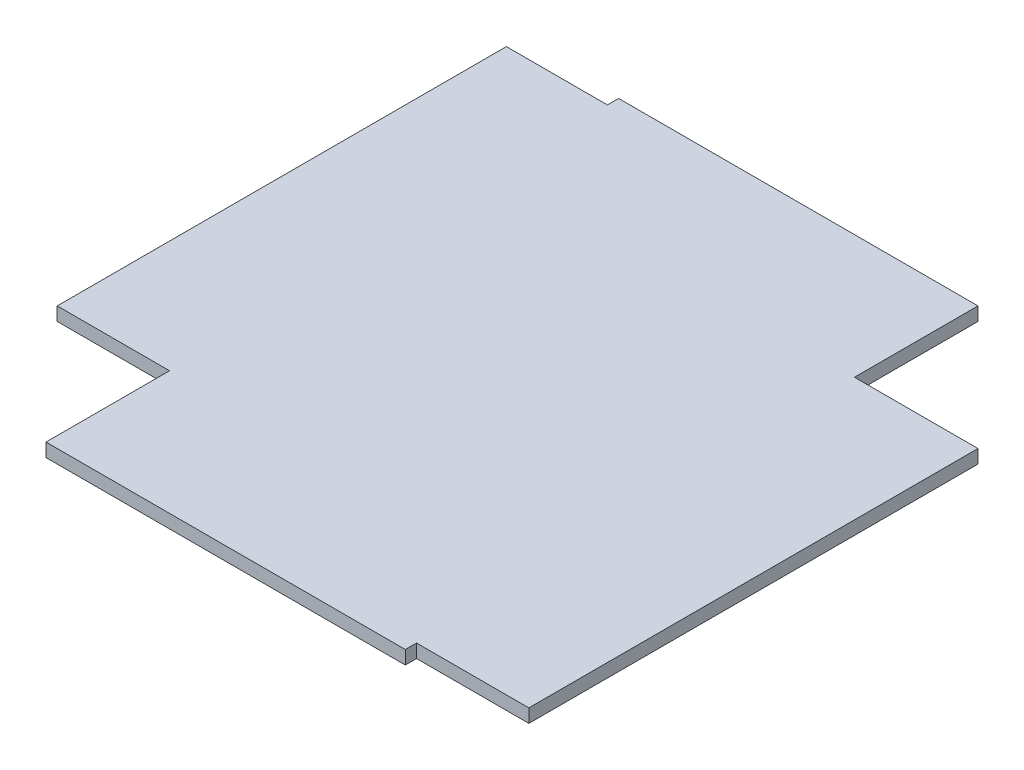
ISO-10303-21;
HEADER;
FILE_DESCRIPTION(('STEP AP214'),'2;1');
FILE_NAME('part.step','',(''),(''),'','','');
FILE_SCHEMA(('AUTOMOTIVE_DESIGN { 1 0 10303 214 1 1 1 1 }'));
ENDSEC;
DATA;
#1=APPLICATION_CONTEXT('core data for automotive mechanical design processes');
#2=APPLICATION_PROTOCOL_DEFINITION('international standard','automotive_design',2000,#1);
#3=PRODUCT_CONTEXT('',#1,'mechanical');
#4=PRODUCT('Part','Part','',(#3));
#5=PRODUCT_RELATED_PRODUCT_CATEGORY('part','',(#4));
#6=PRODUCT_DEFINITION_FORMATION('','',#4);
#7=PRODUCT_DEFINITION_CONTEXT('part definition',#1,'design');
#8=PRODUCT_DEFINITION('design','',#6,#7);
#9=PRODUCT_DEFINITION_SHAPE('','',#8);
#10=(LENGTH_UNIT() NAMED_UNIT(*) SI_UNIT(.MILLI.,.METRE.));
#11=(NAMED_UNIT(*) PLANE_ANGLE_UNIT() SI_UNIT($,.RADIAN.));
#12=(NAMED_UNIT(*) SI_UNIT($,.STERADIAN.) SOLID_ANGLE_UNIT());
#13=UNCERTAINTY_MEASURE_WITH_UNIT(LENGTH_MEASURE(1.E-05),#10,'distance_accuracy_value','');
#14=(GEOMETRIC_REPRESENTATION_CONTEXT(3) GLOBAL_UNCERTAINTY_ASSIGNED_CONTEXT((#13)) GLOBAL_UNIT_ASSIGNED_CONTEXT((#10,
#11,#12)) REPRESENTATION_CONTEXT('',''));
#15=CARTESIAN_POINT('',(0.,0.,0.));
#16=DIRECTION('',(0.,0.,1.));
#17=DIRECTION('',(1.,0.,0.));
#18=AXIS2_PLACEMENT_3D('',#15,#16,#17);
#19=CARTESIAN_POINT('',(-75.,6.,-75.));
#20=DIRECTION('',(0.,0.,1.));
#21=DIRECTION('',(1.,0.,0.));
#22=AXIS2_PLACEMENT_3D('',#19,#20,#21);
#23=PLANE('',#22);
#24=DIRECTION('',(-1.,0.,0.));
#25=VECTOR('',#24,1.);
#26=CARTESIAN_POINT('',(-75.,0.,-75.));
#27=LINE('',#26,#25);
#28=CARTESIAN_POINT('',(130.,0.,-75.));
#29=VERTEX_POINT('',#28);
#30=CARTESIAN_POINT('',(75.,0.,-75.));
#31=VERTEX_POINT('',#30);
#32=EDGE_CURVE('E138',#29,#31,#27,.T.);
#33=ORIENTED_EDGE('',*,*,#32,.T.);
#34=DIRECTION('',(0.,1.,0.));
#35=VECTOR('',#34,1.);
#36=CARTESIAN_POINT('',(75.,0.,-75.));
#37=LINE('',#36,#35);
#38=CARTESIAN_POINT('',(75.,6.,-75.));
#39=VERTEX_POINT('',#38);
#40=EDGE_CURVE('E121',#31,#39,#37,.T.);
#41=ORIENTED_EDGE('',*,*,#40,.T.);
#42=DIRECTION('',(-1.,0.,0.));
#43=VECTOR('',#42,1.);
#44=CARTESIAN_POINT('',(-75.,6.,-75.));
#45=LINE('',#44,#43);
#46=CARTESIAN_POINT('',(130.,6.,-75.));
#47=VERTEX_POINT('',#46);
#48=EDGE_CURVE('E147',#47,#39,#45,.T.);
#49=ORIENTED_EDGE('',*,*,#48,.F.);
#50=DIRECTION('',(0.,1.,0.));
#51=VECTOR('',#50,1.);
#52=CARTESIAN_POINT('',(130.,0.,-75.));
#53=LINE('',#52,#51);
#54=EDGE_CURVE('E145',#29,#47,#53,.T.);
#55=ORIENTED_EDGE('',*,*,#54,.F.);
#56=EDGE_LOOP('',(#33,#41,#49,#55));
#57=FACE_BOUND('',#56,.T.);
#58=ADVANCED_FACE('F33',(#57),#23,.F.);
#59=CARTESIAN_POINT('',(0.,6.,0.));
#60=DIRECTION('',(0.,1.,0.));
#61=DIRECTION('',(0.,0.,1.));
#62=AXIS2_PLACEMENT_3D('',#59,#60,#61);
#63=PLANE('',#62);
#64=DIRECTION('',(0.,0.,1.));
#65=VECTOR('',#64,1.);
#66=CARTESIAN_POINT('',(-85.,6.,-75.));
#67=LINE('',#66,#65);
#68=CARTESIAN_POINT('',(-85.,6.,-130.));
#69=VERTEX_POINT('',#68);
#70=CARTESIAN_POINT('',(-85.,6.,-125.));
#71=VERTEX_POINT('',#70);
#72=EDGE_CURVE('E47',#69,#71,#67,.T.);
#73=ORIENTED_EDGE('',*,*,#72,.T.);
#74=DIRECTION('',(-1.,0.,0.));
#75=VECTOR('',#74,1.);
#76=CARTESIAN_POINT('',(-75.,6.,-125.));
#77=LINE('',#76,#75);
#78=CARTESIAN_POINT('',(-130.,6.,-125.));
#79=VERTEX_POINT('',#78);
#80=EDGE_CURVE('E209',#71,#79,#77,.T.);
#81=ORIENTED_EDGE('',*,*,#80,.T.);
#82=DIRECTION('',(0.,0.,1.));
#83=VECTOR('',#82,1.);
#84=CARTESIAN_POINT('',(-130.,6.,75.0000000000001));
#85=LINE('',#84,#83);
#86=CARTESIAN_POINT('',(-130.,6.,75.0000000000001));
#87=VERTEX_POINT('',#86);
#88=EDGE_CURVE('E206',#79,#87,#85,.T.);
#89=ORIENTED_EDGE('',*,*,#88,.T.);
#90=DIRECTION('',(1.,0.,0.));
#91=VECTOR('',#90,1.);
#92=CARTESIAN_POINT('',(-75.,6.,75.0000000000001));
#93=LINE('',#92,#91);
#94=CARTESIAN_POINT('',(-80.,6.,75.0000000000001));
#95=VERTEX_POINT('',#94);
#96=EDGE_CURVE('E202',#87,#95,#93,.T.);
#97=ORIENTED_EDGE('',*,*,#96,.T.);
#98=DIRECTION('',(0.,0.,1.));
#99=VECTOR('',#98,1.);
#100=CARTESIAN_POINT('',(-80.,6.,75.));
#101=LINE('',#100,#99);
#102=CARTESIAN_POINT('',(-80.,6.,130.));
#103=VERTEX_POINT('',#102);
#104=EDGE_CURVE('E186',#95,#103,#101,.T.);
#105=ORIENTED_EDGE('',*,*,#104,.T.);
#106=DIRECTION('',(1.,0.,0.));
#107=VECTOR('',#106,1.);
#108=CARTESIAN_POINT('',(80.,6.,130.));
#109=LINE('',#108,#107);
#110=CARTESIAN_POINT('',(80.,6.,130.));
#111=VERTEX_POINT('',#110);
#112=EDGE_CURVE('E184',#103,#111,#109,.T.);
#113=ORIENTED_EDGE('',*,*,#112,.T.);
#114=DIRECTION('',(0.,0.,-1.));
#115=VECTOR('',#114,1.);
#116=CARTESIAN_POINT('',(80.,6.,75.));
#117=LINE('',#116,#115);
#118=CARTESIAN_POINT('',(80.,6.,125.));
#119=VERTEX_POINT('',#118);
#120=EDGE_CURVE('E53',#111,#119,#117,.T.);
#121=ORIENTED_EDGE('',*,*,#120,.T.);
#122=DIRECTION('',(1.,0.,0.));
#123=VECTOR('',#122,1.);
#124=CARTESIAN_POINT('',(75.,6.,125.));
#125=LINE('',#124,#123);
#126=CARTESIAN_POINT('',(130.,6.,125.));
#127=VERTEX_POINT('',#126);
#128=EDGE_CURVE('E162',#119,#127,#125,.T.);
#129=ORIENTED_EDGE('',*,*,#128,.T.);
#130=DIRECTION('',(0.,0.,-1.));
#131=VECTOR('',#130,1.);
#132=CARTESIAN_POINT('',(130.,6.,-75.));
#133=LINE('',#132,#131);
#134=EDGE_CURVE('E167',#127,#47,#133,.T.);
#135=ORIENTED_EDGE('',*,*,#134,.T.);
#136=ORIENTED_EDGE('',*,*,#48,.T.);
#137=DIRECTION('',(0.,0.,-1.));
#138=VECTOR('',#137,1.);
#139=CARTESIAN_POINT('',(75.,6.,-75.));
#140=LINE('',#139,#138);
#141=CARTESIAN_POINT('',(75.,6.,-130.));
#142=VERTEX_POINT('',#141);
#143=EDGE_CURVE('E127',#39,#142,#140,.T.);
#144=ORIENTED_EDGE('',*,*,#143,.T.);
#145=DIRECTION('',(-1.,0.,0.));
#146=VECTOR('',#145,1.);
#147=CARTESIAN_POINT('',(-85.,6.,-130.));
#148=LINE('',#147,#146);
#149=EDGE_CURVE('E220',#142,#69,#148,.T.);
#150=ORIENTED_EDGE('',*,*,#149,.T.);
#151=EDGE_LOOP('',(#73,#81,#89,#97,#105,#113,#121,#129,#135,#136,#144,#150));
#152=FACE_BOUND('',#151,.T.);
#153=ADVANCED_FACE('F239',(#152),#63,.T.);
#154=CARTESIAN_POINT('',(0.,0.,0.));
#155=DIRECTION('',(0.,1.,0.));
#156=DIRECTION('',(0.,0.,1.));
#157=AXIS2_PLACEMENT_3D('',#154,#155,#156);
#158=PLANE('',#157);
#159=DIRECTION('',(-1.,0.,0.));
#160=VECTOR('',#159,1.);
#161=CARTESIAN_POINT('',(-75.,0.,-125.));
#162=LINE('',#161,#160);
#163=CARTESIAN_POINT('',(-85.,0.,-125.));
#164=VERTEX_POINT('',#163);
#165=CARTESIAN_POINT('',(-130.,0.,-125.));
#166=VERTEX_POINT('',#165);
#167=EDGE_CURVE('E205',#164,#166,#162,.T.);
#168=ORIENTED_EDGE('',*,*,#167,.F.);
#169=DIRECTION('',(0.,0.,1.));
#170=VECTOR('',#169,1.);
#171=CARTESIAN_POINT('',(-85.,0.,-75.));
#172=LINE('',#171,#170);
#173=CARTESIAN_POINT('',(-85.,0.,-130.));
#174=VERTEX_POINT('',#173);
#175=EDGE_CURVE('E142',#174,#164,#172,.T.);
#176=ORIENTED_EDGE('',*,*,#175,.F.);
#177=DIRECTION('',(-1.,0.,0.));
#178=VECTOR('',#177,1.);
#179=CARTESIAN_POINT('',(-85.,0.,-130.));
#180=LINE('',#179,#178);
#181=CARTESIAN_POINT('',(75.,0.,-130.));
#182=VERTEX_POINT('',#181);
#183=EDGE_CURVE('E132',#182,#174,#180,.T.);
#184=ORIENTED_EDGE('',*,*,#183,.F.);
#185=DIRECTION('',(0.,0.,-1.));
#186=VECTOR('',#185,1.);
#187=CARTESIAN_POINT('',(75.,0.,-75.));
#188=LINE('',#187,#186);
#189=EDGE_CURVE('E124',#31,#182,#188,.T.);
#190=ORIENTED_EDGE('',*,*,#189,.F.);
#191=ORIENTED_EDGE('',*,*,#32,.F.);
#192=DIRECTION('',(0.,0.,-1.));
#193=VECTOR('',#192,1.);
#194=CARTESIAN_POINT('',(130.,0.,-75.));
#195=LINE('',#194,#193);
#196=CARTESIAN_POINT('',(130.,0.,125.));
#197=VERTEX_POINT('',#196);
#198=EDGE_CURVE('E175',#197,#29,#195,.T.);
#199=ORIENTED_EDGE('',*,*,#198,.F.);
#200=DIRECTION('',(1.,0.,0.));
#201=VECTOR('',#200,1.);
#202=CARTESIAN_POINT('',(75.,0.,125.));
#203=LINE('',#202,#201);
#204=CARTESIAN_POINT('',(80.,0.,125.));
#205=VERTEX_POINT('',#204);
#206=EDGE_CURVE('E170',#205,#197,#203,.T.);
#207=ORIENTED_EDGE('',*,*,#206,.F.);
#208=DIRECTION('',(0.,0.,-1.));
#209=VECTOR('',#208,1.);
#210=CARTESIAN_POINT('',(80.,0.,75.));
#211=LINE('',#210,#209);
#212=CARTESIAN_POINT('',(80.,0.,130.));
#213=VERTEX_POINT('',#212);
#214=EDGE_CURVE('E158',#213,#205,#211,.T.);
#215=ORIENTED_EDGE('',*,*,#214,.F.);
#216=DIRECTION('',(1.,0.,0.));
#217=VECTOR('',#216,1.);
#218=CARTESIAN_POINT('',(80.,0.,130.));
#219=LINE('',#218,#217);
#220=CARTESIAN_POINT('',(-80.,0.,130.));
#221=VERTEX_POINT('',#220);
#222=EDGE_CURVE('E182',#221,#213,#219,.T.);
#223=ORIENTED_EDGE('',*,*,#222,.F.);
#224=DIRECTION('',(0.,0.,1.));
#225=VECTOR('',#224,1.);
#226=CARTESIAN_POINT('',(-80.,0.,75.));
#227=LINE('',#226,#225);
#228=CARTESIAN_POINT('',(-80.,0.,75.));
#229=VERTEX_POINT('',#228);
#230=EDGE_CURVE('E193',#229,#221,#227,.T.);
#231=ORIENTED_EDGE('',*,*,#230,.F.);
#232=DIRECTION('',(1.,0.,0.));
#233=VECTOR('',#232,1.);
#234=CARTESIAN_POINT('',(-75.,0.,75.0000000000001));
#235=LINE('',#234,#233);
#236=CARTESIAN_POINT('',(-130.,0.,75.0000000000001));
#237=VERTEX_POINT('',#236);
#238=EDGE_CURVE('E200',#237,#229,#235,.T.);
#239=ORIENTED_EDGE('',*,*,#238,.F.);
#240=DIRECTION('',(0.,0.,1.));
#241=VECTOR('',#240,1.);
#242=CARTESIAN_POINT('',(-130.,0.,75.0000000000001));
#243=LINE('',#242,#241);
#244=EDGE_CURVE('E214',#166,#237,#243,.T.);
#245=ORIENTED_EDGE('',*,*,#244,.F.);
#246=EDGE_LOOP('',(#168,#176,#184,#190,#191,#199,#207,#215,#223,#231,#239,#245));
#247=FACE_BOUND('',#246,.T.);
#248=ADVANCED_FACE('F136',(#247),#158,.F.);
#249=CARTESIAN_POINT('',(130.,0.,-75.));
#250=DIRECTION('',(1.,0.,0.));
#251=DIRECTION('',(0.,0.,-1.));
#252=AXIS2_PLACEMENT_3D('',#249,#250,#251);
#253=PLANE('',#252);
#254=ORIENTED_EDGE('',*,*,#134,.F.);
#255=DIRECTION('',(0.,1.,0.));
#256=VECTOR('',#255,1.);
#257=CARTESIAN_POINT('',(130.,0.,125.));
#258=LINE('',#257,#256);
#259=EDGE_CURVE('E150',#197,#127,#258,.T.);
#260=ORIENTED_EDGE('',*,*,#259,.F.);
#261=ORIENTED_EDGE('',*,*,#198,.T.);
#262=ORIENTED_EDGE('',*,*,#54,.T.);
#263=EDGE_LOOP('',(#254,#260,#261,#262));
#264=FACE_BOUND('',#263,.T.);
#265=ADVANCED_FACE('F265',(#264),#253,.T.);
#266=CARTESIAN_POINT('',(75.,0.,125.));
#267=DIRECTION('',(0.,0.,1.));
#268=DIRECTION('',(1.,0.,0.));
#269=AXIS2_PLACEMENT_3D('',#266,#267,#268);
#270=PLANE('',#269);
#271=DIRECTION('',(0.,1.,0.));
#272=VECTOR('',#271,1.);
#273=CARTESIAN_POINT('',(80.,0.,125.));
#274=LINE('',#273,#272);
#275=EDGE_CURVE('E40',#205,#119,#274,.T.);
#276=ORIENTED_EDGE('',*,*,#275,.F.);
#277=ORIENTED_EDGE('',*,*,#206,.T.);
#278=ORIENTED_EDGE('',*,*,#259,.T.);
#279=ORIENTED_EDGE('',*,*,#128,.F.);
#280=EDGE_LOOP('',(#276,#277,#278,#279));
#281=FACE_BOUND('',#280,.T.);
#282=ADVANCED_FACE('F163',(#281),#270,.T.);
#283=CARTESIAN_POINT('',(80.,0.,75.));
#284=DIRECTION('',(1.,0.,0.));
#285=DIRECTION('',(0.,0.,-1.));
#286=AXIS2_PLACEMENT_3D('',#283,#284,#285);
#287=PLANE('',#286);
#288=ORIENTED_EDGE('',*,*,#214,.T.);
#289=ORIENTED_EDGE('',*,*,#275,.T.);
#290=ORIENTED_EDGE('',*,*,#120,.F.);
#291=DIRECTION('',(0.,1.,0.));
#292=VECTOR('',#291,1.);
#293=CARTESIAN_POINT('',(80.,0.,130.));
#294=LINE('',#293,#292);
#295=EDGE_CURVE('E168',#213,#111,#294,.T.);
#296=ORIENTED_EDGE('',*,*,#295,.F.);
#297=EDGE_LOOP('',(#288,#289,#290,#296));
#298=FACE_BOUND('',#297,.T.);
#299=ADVANCED_FACE('F156',(#298),#287,.T.);
#300=CARTESIAN_POINT('',(80.,0.,130.));
#301=DIRECTION('',(0.,0.,1.));
#302=DIRECTION('',(1.,0.,0.));
#303=AXIS2_PLACEMENT_3D('',#300,#301,#302);
#304=PLANE('',#303);
#305=ORIENTED_EDGE('',*,*,#112,.F.);
#306=DIRECTION('',(0.,1.,0.));
#307=VECTOR('',#306,1.);
#308=CARTESIAN_POINT('',(-80.,0.,130.));
#309=LINE('',#308,#307);
#310=EDGE_CURVE('E172',#221,#103,#309,.T.);
#311=ORIENTED_EDGE('',*,*,#310,.F.);
#312=ORIENTED_EDGE('',*,*,#222,.T.);
#313=ORIENTED_EDGE('',*,*,#295,.T.);
#314=EDGE_LOOP('',(#305,#311,#312,#313));
#315=FACE_BOUND('',#314,.T.);
#316=ADVANCED_FACE('F247',(#315),#304,.T.);
#317=CARTESIAN_POINT('',(-80.,0.,75.));
#318=DIRECTION('',(-1.,0.,0.));
#319=DIRECTION('',(0.,0.,1.));
#320=AXIS2_PLACEMENT_3D('',#317,#318,#319);
#321=PLANE('',#320);
#322=ORIENTED_EDGE('',*,*,#104,.F.);
#323=DIRECTION('',(0.,1.,0.));
#324=VECTOR('',#323,1.);
#325=CARTESIAN_POINT('',(-80.,0.,75.));
#326=LINE('',#325,#324);
#327=EDGE_CURVE('E179',#229,#95,#326,.T.);
#328=ORIENTED_EDGE('',*,*,#327,.F.);
#329=ORIENTED_EDGE('',*,*,#230,.T.);
#330=ORIENTED_EDGE('',*,*,#310,.T.);
#331=EDGE_LOOP('',(#322,#328,#329,#330));
#332=FACE_BOUND('',#331,.T.);
#333=ADVANCED_FACE('F243',(#332),#321,.T.);
#334=CARTESIAN_POINT('',(-75.,0.,75.0000000000001));
#335=DIRECTION('',(0.,0.,1.));
#336=DIRECTION('',(1.,0.,0.));
#337=AXIS2_PLACEMENT_3D('',#334,#335,#336);
#338=PLANE('',#337);
#339=ORIENTED_EDGE('',*,*,#238,.T.);
#340=ORIENTED_EDGE('',*,*,#327,.T.);
#341=ORIENTED_EDGE('',*,*,#96,.F.);
#342=DIRECTION('',(0.,1.,0.));
#343=VECTOR('',#342,1.);
#344=CARTESIAN_POINT('',(-130.,0.,75.0000000000001));
#345=LINE('',#344,#343);
#346=EDGE_CURVE('E190',#237,#87,#345,.T.);
#347=ORIENTED_EDGE('',*,*,#346,.F.);
#348=EDGE_LOOP('',(#339,#340,#341,#347));
#349=FACE_BOUND('',#348,.T.);
#350=ADVANCED_FACE('F241',(#349),#338,.T.);
#351=CARTESIAN_POINT('',(-130.,0.,75.0000000000001));
#352=DIRECTION('',(-1.,0.,0.));
#353=DIRECTION('',(0.,0.,1.));
#354=AXIS2_PLACEMENT_3D('',#351,#352,#353);
#355=PLANE('',#354);
#356=ORIENTED_EDGE('',*,*,#88,.F.);
#357=DIRECTION('',(0.,1.,0.));
#358=VECTOR('',#357,1.);
#359=CARTESIAN_POINT('',(-130.,0.,-125.));
#360=LINE('',#359,#358);
#361=EDGE_CURVE('E197',#166,#79,#360,.T.);
#362=ORIENTED_EDGE('',*,*,#361,.F.);
#363=ORIENTED_EDGE('',*,*,#244,.T.);
#364=ORIENTED_EDGE('',*,*,#346,.T.);
#365=EDGE_LOOP('',(#356,#362,#363,#364));
#366=FACE_BOUND('',#365,.T.);
#367=ADVANCED_FACE('F237',(#366),#355,.T.);
#368=CARTESIAN_POINT('',(-75.,0.,-125.));
#369=DIRECTION('',(0.,0.,-1.));
#370=DIRECTION('',(-1.,0.,0.));
#371=AXIS2_PLACEMENT_3D('',#368,#369,#370);
#372=PLANE('',#371);
#373=DIRECTION('',(0.,1.,0.));
#374=VECTOR('',#373,1.);
#375=CARTESIAN_POINT('',(-85.,0.,-125.));
#376=LINE('',#375,#374);
#377=EDGE_CURVE('E11',#164,#71,#376,.T.);
#378=ORIENTED_EDGE('',*,*,#377,.F.);
#379=ORIENTED_EDGE('',*,*,#167,.T.);
#380=ORIENTED_EDGE('',*,*,#361,.T.);
#381=ORIENTED_EDGE('',*,*,#80,.F.);
#382=EDGE_LOOP('',(#378,#379,#380,#381));
#383=FACE_BOUND('',#382,.T.);
#384=ADVANCED_FACE('F230',(#383),#372,.T.);
#385=CARTESIAN_POINT('',(-85.,0.,-75.));
#386=DIRECTION('',(-1.,0.,0.));
#387=DIRECTION('',(0.,0.,1.));
#388=AXIS2_PLACEMENT_3D('',#385,#386,#387);
#389=PLANE('',#388);
#390=ORIENTED_EDGE('',*,*,#175,.T.);
#391=ORIENTED_EDGE('',*,*,#377,.T.);
#392=ORIENTED_EDGE('',*,*,#72,.F.);
#393=DIRECTION('',(0.,1.,0.));
#394=VECTOR('',#393,1.);
#395=CARTESIAN_POINT('',(-85.,0.,-130.));
#396=LINE('',#395,#394);
#397=EDGE_CURVE('E211',#174,#69,#396,.T.);
#398=ORIENTED_EDGE('',*,*,#397,.F.);
#399=EDGE_LOOP('',(#390,#391,#392,#398));
#400=FACE_BOUND('',#399,.T.);
#401=ADVANCED_FACE('F227',(#400),#389,.T.);
#402=CARTESIAN_POINT('',(-85.,0.,-130.));
#403=DIRECTION('',(0.,0.,-1.));
#404=DIRECTION('',(-1.,0.,0.));
#405=AXIS2_PLACEMENT_3D('',#402,#403,#404);
#406=PLANE('',#405);
#407=ORIENTED_EDGE('',*,*,#149,.F.);
#408=DIRECTION('',(0.,1.,0.));
#409=VECTOR('',#408,1.);
#410=CARTESIAN_POINT('',(75.,0.,-130.));
#411=LINE('',#410,#409);
#412=EDGE_CURVE('E131',#182,#142,#411,.T.);
#413=ORIENTED_EDGE('',*,*,#412,.F.);
#414=ORIENTED_EDGE('',*,*,#183,.T.);
#415=ORIENTED_EDGE('',*,*,#397,.T.);
#416=EDGE_LOOP('',(#407,#413,#414,#415));
#417=FACE_BOUND('',#416,.T.);
#418=ADVANCED_FACE('F274',(#417),#406,.T.);
#419=CARTESIAN_POINT('',(75.,0.,-75.));
#420=DIRECTION('',(1.,0.,0.));
#421=DIRECTION('',(0.,0.,-1.));
#422=AXIS2_PLACEMENT_3D('',#419,#420,#421);
#423=PLANE('',#422);
#424=ORIENTED_EDGE('',*,*,#143,.F.);
#425=ORIENTED_EDGE('',*,*,#40,.F.);
#426=ORIENTED_EDGE('',*,*,#189,.T.);
#427=ORIENTED_EDGE('',*,*,#412,.T.);
#428=EDGE_LOOP('',(#424,#425,#426,#427));
#429=FACE_BOUND('',#428,.T.);
#430=ADVANCED_FACE('F123',(#429),#423,.T.);
#431=CLOSED_SHELL('',(#58,#153,#248,#265,#282,#299,#316,#333,#350,#367,#384,#401,#418,#430));
#432=MANIFOLD_SOLID_BREP('B2',#431);
#433=ADVANCED_BREP_SHAPE_REPRESENTATION('',(#18,#432),#14);
#434=SHAPE_DEFINITION_REPRESENTATION(#9,#433);
ENDSEC;
END-ISO-10303-21;
